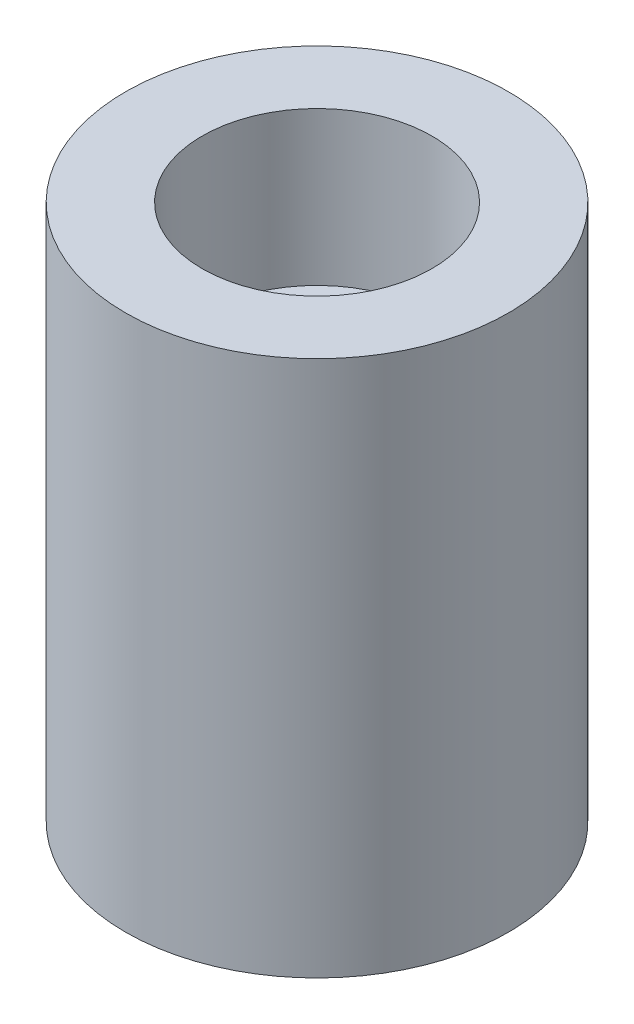
ISO-10303-21;
HEADER;
FILE_DESCRIPTION(('STEP AP214'),'2;1');
FILE_NAME('part.step','',(''),(''),'','','');
FILE_SCHEMA(('AUTOMOTIVE_DESIGN { 1 0 10303 214 1 1 1 1 }'));
ENDSEC;
DATA;
#1=APPLICATION_CONTEXT('core data for automotive mechanical design processes');
#2=APPLICATION_PROTOCOL_DEFINITION('international standard','automotive_design',2000,#1);
#3=PRODUCT_CONTEXT('',#1,'mechanical');
#4=PRODUCT('Part','Part','',(#3));
#5=PRODUCT_RELATED_PRODUCT_CATEGORY('part','',(#4));
#6=PRODUCT_DEFINITION_FORMATION('','',#4);
#7=PRODUCT_DEFINITION_CONTEXT('part definition',#1,'design');
#8=PRODUCT_DEFINITION('design','',#6,#7);
#9=PRODUCT_DEFINITION_SHAPE('','',#8);
#10=(LENGTH_UNIT() NAMED_UNIT(*) SI_UNIT(.MILLI.,.METRE.));
#11=(NAMED_UNIT(*) PLANE_ANGLE_UNIT() SI_UNIT($,.RADIAN.));
#12=(NAMED_UNIT(*) SI_UNIT($,.STERADIAN.) SOLID_ANGLE_UNIT());
#13=UNCERTAINTY_MEASURE_WITH_UNIT(LENGTH_MEASURE(1.E-05),#10,'distance_accuracy_value','');
#14=(GEOMETRIC_REPRESENTATION_CONTEXT(3) GLOBAL_UNCERTAINTY_ASSIGNED_CONTEXT((#13)) GLOBAL_UNIT_ASSIGNED_CONTEXT((#10,
#11,#12)) REPRESENTATION_CONTEXT('',''));
#15=CARTESIAN_POINT('',(0.,0.,0.));
#16=DIRECTION('',(0.,0.,1.));
#17=DIRECTION('',(1.,0.,0.));
#18=AXIS2_PLACEMENT_3D('',#15,#16,#17);
#19=CARTESIAN_POINT('',(0.,140.,0.));
#20=DIRECTION('',(0.,-1.,0.));
#21=DIRECTION('',(0.,0.,-1.));
#22=AXIS2_PLACEMENT_3D('',#19,#20,#21);
#23=CYLINDRICAL_SURFACE('',#22,50.);
#24=CARTESIAN_POINT('',(0.,140.,0.));
#25=DIRECTION('',(0.,1.,0.));
#26=DIRECTION('',(0.,0.,1.));
#27=AXIS2_PLACEMENT_3D('',#24,#25,#26);
#28=CIRCLE('',#27,50.);
#29=CARTESIAN_POINT('',(0.,140.,50.));
#30=VERTEX_POINT('',#29);
#31=EDGE_CURVE('E10',#30,#30,#28,.T.);
#32=ORIENTED_EDGE('',*,*,#31,.F.);
#33=EDGE_LOOP('',(#32));
#34=FACE_BOUND('',#33,.T.);
#35=CARTESIAN_POINT('',(0.,0.,0.));
#36=DIRECTION('',(0.,1.,0.));
#37=DIRECTION('',(0.,0.,1.));
#38=AXIS2_PLACEMENT_3D('',#35,#36,#37);
#39=CIRCLE('',#38,50.);
#40=CARTESIAN_POINT('',(0.,0.,50.));
#41=VERTEX_POINT('',#40);
#42=EDGE_CURVE('E33',#41,#41,#39,.T.);
#43=ORIENTED_EDGE('',*,*,#42,.T.);
#44=EDGE_LOOP('',(#43));
#45=FACE_BOUND('',#44,.T.);
#46=ADVANCED_FACE('F30',(#34,#45),#23,.T.);
#47=CARTESIAN_POINT('',(0.,140.,0.));
#48=DIRECTION('',(0.,1.,0.));
#49=DIRECTION('',(0.,0.,1.));
#50=AXIS2_PLACEMENT_3D('',#47,#48,#49);
#51=PLANE('',#50);
#52=CARTESIAN_POINT('',(0.,140.,0.));
#53=DIRECTION('',(0.,1.,0.));
#54=DIRECTION('',(0.,0.,1.));
#55=AXIS2_PLACEMENT_3D('',#52,#53,#54);
#56=CIRCLE('',#55,30.);
#57=CARTESIAN_POINT('',(0.,140.,30.));
#58=VERTEX_POINT('',#57);
#59=EDGE_CURVE('E42',#58,#58,#56,.T.);
#60=ORIENTED_EDGE('',*,*,#59,.F.);
#61=EDGE_LOOP('',(#60));
#62=FACE_BOUND('',#61,.T.);
#63=ORIENTED_EDGE('',*,*,#31,.T.);
#64=EDGE_LOOP('',(#63));
#65=FACE_BOUND('',#64,.T.);
#66=ADVANCED_FACE('F75',(#62,#65),#51,.T.);
#67=CARTESIAN_POINT('',(0.,0.,0.));
#68=DIRECTION('',(0.,1.,0.));
#69=DIRECTION('',(0.,0.,1.));
#70=AXIS2_PLACEMENT_3D('',#67,#68,#69);
#71=PLANE('',#70);
#72=ORIENTED_EDGE('',*,*,#42,.F.);
#73=EDGE_LOOP('',(#72));
#74=FACE_BOUND('',#73,.T.);
#75=ADVANCED_FACE('F71',(#74),#71,.F.);
#76=CARTESIAN_POINT('',(0.,100.,0.));
#77=DIRECTION('',(0.,1.,0.));
#78=DIRECTION('',(0.,0.,1.));
#79=AXIS2_PLACEMENT_3D('',#76,#77,#78);
#80=CYLINDRICAL_SURFACE('',#79,30.);
#81=CARTESIAN_POINT('',(0.,100.,0.));
#82=DIRECTION('',(0.,1.,0.));
#83=DIRECTION('',(0.,0.,1.));
#84=AXIS2_PLACEMENT_3D('',#81,#82,#83);
#85=CIRCLE('',#84,30.);
#86=CARTESIAN_POINT('',(0.,100.,30.));
#87=VERTEX_POINT('',#86);
#88=EDGE_CURVE('E40',#87,#87,#85,.T.);
#89=ORIENTED_EDGE('',*,*,#88,.F.);
#90=EDGE_LOOP('',(#89));
#91=FACE_BOUND('',#90,.T.);
#92=ORIENTED_EDGE('',*,*,#59,.T.);
#93=EDGE_LOOP('',(#92));
#94=FACE_BOUND('',#93,.T.);
#95=ADVANCED_FACE('F65',(#91,#94),#80,.F.);
#96=CARTESIAN_POINT('',(0.,100.,0.));
#97=DIRECTION('',(0.,1.,0.));
#98=DIRECTION('',(0.,0.,1.));
#99=AXIS2_PLACEMENT_3D('',#96,#97,#98);
#100=PLANE('',#99);
#101=CARTESIAN_POINT('',(0.,100.,0.));
#102=DIRECTION('',(0.,1.,0.));
#103=DIRECTION('',(0.,0.,1.));
#104=AXIS2_PLACEMENT_3D('',#101,#102,#103);
#105=CIRCLE('',#104,10.);
#106=CARTESIAN_POINT('',(0.,100.,10.));
#107=VERTEX_POINT('',#106);
#108=EDGE_CURVE('E48',#107,#107,#105,.T.);
#109=ORIENTED_EDGE('',*,*,#108,.F.);
#110=EDGE_LOOP('',(#109));
#111=FACE_BOUND('',#110,.T.);
#112=ORIENTED_EDGE('',*,*,#88,.T.);
#113=EDGE_LOOP('',(#112));
#114=FACE_BOUND('',#113,.T.);
#115=ADVANCED_FACE('F59',(#111,#114),#100,.T.);
#116=CARTESIAN_POINT('',(0.,20.,0.));
#117=DIRECTION('',(0.,1.,0.));
#118=DIRECTION('',(0.,0.,1.));
#119=AXIS2_PLACEMENT_3D('',#116,#117,#118);
#120=CYLINDRICAL_SURFACE('',#119,10.);
#121=CARTESIAN_POINT('',(0.,20.,0.));
#122=DIRECTION('',(0.,1.,0.));
#123=DIRECTION('',(0.,0.,1.));
#124=AXIS2_PLACEMENT_3D('',#121,#122,#123);
#125=CIRCLE('',#124,10.);
#126=CARTESIAN_POINT('',(0.,20.,10.));
#127=VERTEX_POINT('',#126);
#128=EDGE_CURVE('E45',#127,#127,#125,.T.);
#129=ORIENTED_EDGE('',*,*,#128,.F.);
#130=EDGE_LOOP('',(#129));
#131=FACE_BOUND('',#130,.T.);
#132=ORIENTED_EDGE('',*,*,#108,.T.);
#133=EDGE_LOOP('',(#132));
#134=FACE_BOUND('',#133,.T.);
#135=ADVANCED_FACE('F56',(#131,#134),#120,.F.);
#136=CARTESIAN_POINT('',(0.,20.,0.));
#137=DIRECTION('',(0.,1.,0.));
#138=DIRECTION('',(0.,0.,1.));
#139=AXIS2_PLACEMENT_3D('',#136,#137,#138);
#140=PLANE('',#139);
#141=ORIENTED_EDGE('',*,*,#128,.T.);
#142=EDGE_LOOP('',(#141));
#143=FACE_BOUND('',#142,.T.);
#144=ADVANCED_FACE('F54',(#143),#140,.T.);
#145=CLOSED_SHELL('',(#46,#66,#75,#95,#115,#135,#144));
#146=MANIFOLD_SOLID_BREP('B2',#145);
#147=ADVANCED_BREP_SHAPE_REPRESENTATION('',(#18,#146),#14);
#148=SHAPE_DEFINITION_REPRESENTATION(#9,#147);
ENDSEC;
END-ISO-10303-21;
